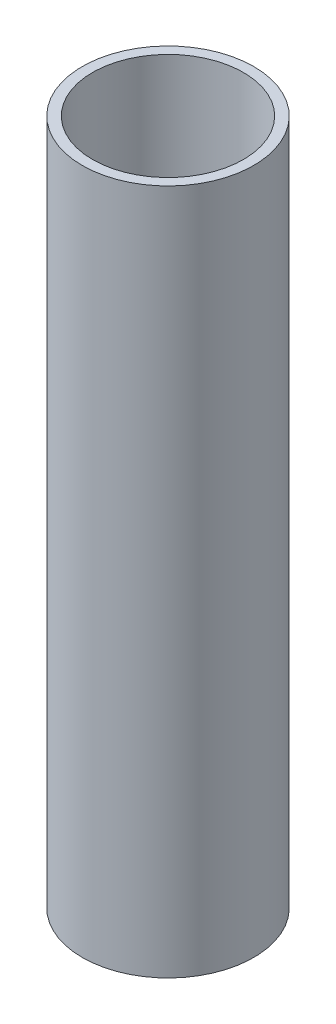
ISO-10303-21;
HEADER;
FILE_DESCRIPTION(('STEP AP214'),'2;1');
FILE_NAME('part.step','',(''),(''),'','','');
FILE_SCHEMA(('AUTOMOTIVE_DESIGN { 1 0 10303 214 1 1 1 1 }'));
ENDSEC;
DATA;
#1=APPLICATION_CONTEXT('core data for automotive mechanical design processes');
#2=APPLICATION_PROTOCOL_DEFINITION('international standard','automotive_design',2000,#1);
#3=PRODUCT_CONTEXT('',#1,'mechanical');
#4=PRODUCT('Part','Part','',(#3));
#5=PRODUCT_RELATED_PRODUCT_CATEGORY('part','',(#4));
#6=PRODUCT_DEFINITION_FORMATION('','',#4);
#7=PRODUCT_DEFINITION_CONTEXT('part definition',#1,'design');
#8=PRODUCT_DEFINITION('design','',#6,#7);
#9=PRODUCT_DEFINITION_SHAPE('','',#8);
#10=(LENGTH_UNIT() NAMED_UNIT(*) SI_UNIT(.MILLI.,.METRE.));
#11=(NAMED_UNIT(*) PLANE_ANGLE_UNIT() SI_UNIT($,.RADIAN.));
#12=(NAMED_UNIT(*) SI_UNIT($,.STERADIAN.) SOLID_ANGLE_UNIT());
#13=UNCERTAINTY_MEASURE_WITH_UNIT(LENGTH_MEASURE(1.E-05),#10,'distance_accuracy_value','');
#14=(GEOMETRIC_REPRESENTATION_CONTEXT(3) GLOBAL_UNCERTAINTY_ASSIGNED_CONTEXT((#13)) GLOBAL_UNIT_ASSIGNED_CONTEXT((#10,
#11,#12)) REPRESENTATION_CONTEXT('',''));
#15=CARTESIAN_POINT('',(0.,0.,0.));
#16=DIRECTION('',(0.,0.,1.));
#17=DIRECTION('',(1.,0.,0.));
#18=AXIS2_PLACEMENT_3D('',#15,#16,#17);
#19=CARTESIAN_POINT('',(0.,101.6,0.));
#20=DIRECTION('',(0.,1.,0.));
#21=DIRECTION('',(0.,0.,1.));
#22=AXIS2_PLACEMENT_3D('',#19,#20,#21);
#23=PLANE('',#22);
#24=CARTESIAN_POINT('',(0.,101.6,0.));
#25=DIRECTION('',(0.,1.,0.));
#26=DIRECTION('',(0.,0.,1.));
#27=AXIS2_PLACEMENT_3D('',#24,#25,#26);
#28=CIRCLE('',#27,12.7);
#29=CARTESIAN_POINT('',(0.,101.6,12.7));
#30=VERTEX_POINT('',#29);
#31=EDGE_CURVE('E10',#30,#30,#28,.T.);
#32=ORIENTED_EDGE('',*,*,#31,.T.);
#33=EDGE_LOOP('',(#32));
#34=FACE_BOUND('',#33,.T.);
#35=CARTESIAN_POINT('',(0.,101.6,0.));
#36=DIRECTION('',(0.,1.,0.));
#37=DIRECTION('',(0.,0.,1.));
#38=AXIS2_PLACEMENT_3D('',#35,#36,#37);
#39=CIRCLE('',#38,11.176);
#40=CARTESIAN_POINT('',(0.,101.6,11.176));
#41=VERTEX_POINT('',#40);
#42=EDGE_CURVE('E42',#41,#41,#39,.T.);
#43=ORIENTED_EDGE('',*,*,#42,.F.);
#44=EDGE_LOOP('',(#43));
#45=FACE_BOUND('',#44,.T.);
#46=ADVANCED_FACE('F31',(#34,#45),#23,.T.);
#47=CARTESIAN_POINT('',(0.,0.,0.));
#48=DIRECTION('',(0.,1.,0.));
#49=DIRECTION('',(0.,0.,1.));
#50=AXIS2_PLACEMENT_3D('',#47,#48,#49);
#51=PLANE('',#50);
#52=CARTESIAN_POINT('',(0.,0.,0.));
#53=DIRECTION('',(0.,1.,0.));
#54=DIRECTION('',(0.,0.,1.));
#55=AXIS2_PLACEMENT_3D('',#52,#53,#54);
#56=CIRCLE('',#55,12.7);
#57=CARTESIAN_POINT('',(0.,0.,12.7));
#58=VERTEX_POINT('',#57);
#59=EDGE_CURVE('E35',#58,#58,#56,.T.);
#60=ORIENTED_EDGE('',*,*,#59,.F.);
#61=EDGE_LOOP('',(#60));
#62=FACE_BOUND('',#61,.T.);
#63=CARTESIAN_POINT('',(0.,0.,0.));
#64=DIRECTION('',(0.,1.,0.));
#65=DIRECTION('',(0.,0.,1.));
#66=AXIS2_PLACEMENT_3D('',#63,#64,#65);
#67=CIRCLE('',#66,11.176);
#68=CARTESIAN_POINT('',(0.,0.,11.176));
#69=VERTEX_POINT('',#68);
#70=EDGE_CURVE('E44',#69,#69,#67,.T.);
#71=ORIENTED_EDGE('',*,*,#70,.T.);
#72=EDGE_LOOP('',(#71));
#73=FACE_BOUND('',#72,.T.);
#74=ADVANCED_FACE('F54',(#62,#73),#51,.F.);
#75=CARTESIAN_POINT('',(0.,101.6,0.));
#76=DIRECTION('',(0.,-1.,0.));
#77=DIRECTION('',(0.,0.,-1.));
#78=AXIS2_PLACEMENT_3D('',#75,#76,#77);
#79=CYLINDRICAL_SURFACE('',#78,12.7);
#80=ORIENTED_EDGE('',*,*,#31,.F.);
#81=EDGE_LOOP('',(#80));
#82=FACE_BOUND('',#81,.T.);
#83=ORIENTED_EDGE('',*,*,#59,.T.);
#84=EDGE_LOOP('',(#83));
#85=FACE_BOUND('',#84,.T.);
#86=ADVANCED_FACE('F33',(#82,#85),#79,.T.);
#87=CARTESIAN_POINT('',(0.,101.6,0.));
#88=DIRECTION('',(0.,-1.,0.));
#89=DIRECTION('',(0.,0.,-1.));
#90=AXIS2_PLACEMENT_3D('',#87,#88,#89);
#91=CYLINDRICAL_SURFACE('',#90,11.176);
#92=ORIENTED_EDGE('',*,*,#42,.T.);
#93=EDGE_LOOP('',(#92));
#94=FACE_BOUND('',#93,.T.);
#95=ORIENTED_EDGE('',*,*,#70,.F.);
#96=EDGE_LOOP('',(#95));
#97=FACE_BOUND('',#96,.T.);
#98=ADVANCED_FACE('F50',(#94,#97),#91,.F.);
#99=CLOSED_SHELL('',(#46,#74,#86,#98));
#100=MANIFOLD_SOLID_BREP('B2',#99);
#101=ADVANCED_BREP_SHAPE_REPRESENTATION('',(#18,#100),#14);
#102=SHAPE_DEFINITION_REPRESENTATION(#9,#101);
ENDSEC;
END-ISO-10303-21;
